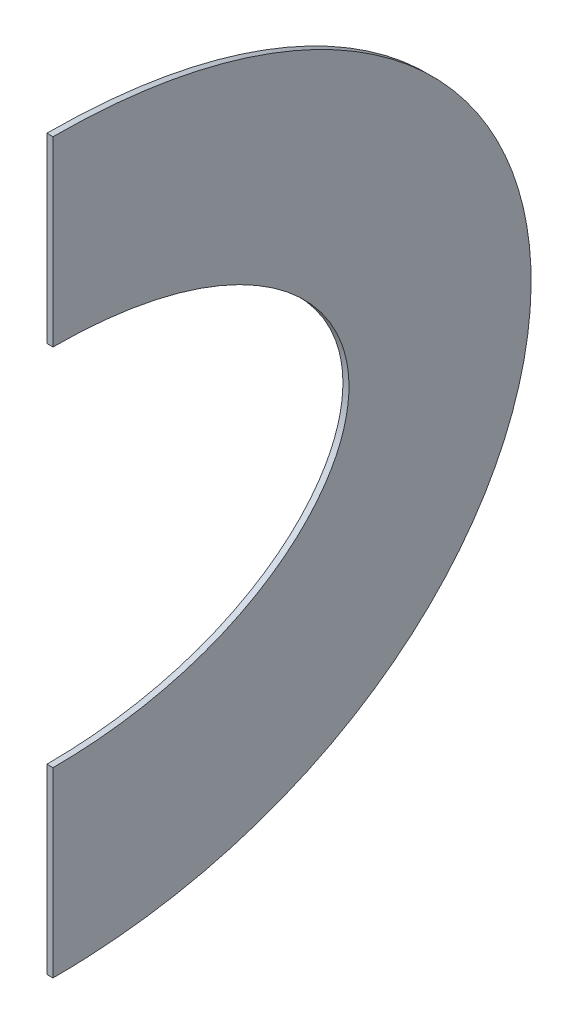
ISO-10303-21;
HEADER;
FILE_DESCRIPTION(('STEP AP214'),'2;1');
FILE_NAME('part.step','',(''),(''),'','','');
FILE_SCHEMA(('AUTOMOTIVE_DESIGN { 1 0 10303 214 1 1 1 1 }'));
ENDSEC;
DATA;
#1=APPLICATION_CONTEXT('core data for automotive mechanical design processes');
#2=APPLICATION_PROTOCOL_DEFINITION('international standard','automotive_design',2000,#1);
#3=PRODUCT_CONTEXT('',#1,'mechanical');
#4=PRODUCT('Part','Part','',(#3));
#5=PRODUCT_RELATED_PRODUCT_CATEGORY('part','',(#4));
#6=PRODUCT_DEFINITION_FORMATION('','',#4);
#7=PRODUCT_DEFINITION_CONTEXT('part definition',#1,'design');
#8=PRODUCT_DEFINITION('design','',#6,#7);
#9=PRODUCT_DEFINITION_SHAPE('','',#8);
#10=(LENGTH_UNIT() NAMED_UNIT(*) SI_UNIT(.MILLI.,.METRE.));
#11=(NAMED_UNIT(*) PLANE_ANGLE_UNIT() SI_UNIT($,.RADIAN.));
#12=(NAMED_UNIT(*) SI_UNIT($,.STERADIAN.) SOLID_ANGLE_UNIT());
#13=UNCERTAINTY_MEASURE_WITH_UNIT(LENGTH_MEASURE(1.E-05),#10,'distance_accuracy_value','');
#14=(GEOMETRIC_REPRESENTATION_CONTEXT(3) GLOBAL_UNCERTAINTY_ASSIGNED_CONTEXT((#13)) GLOBAL_UNIT_ASSIGNED_CONTEXT((#10,
#11,#12)) REPRESENTATION_CONTEXT('',''));
#15=CARTESIAN_POINT('',(0.,0.,0.));
#16=DIRECTION('',(0.,0.,1.));
#17=DIRECTION('',(1.,0.,0.));
#18=AXIS2_PLACEMENT_3D('',#15,#16,#17);
#19=CARTESIAN_POINT('',(0.,0.,0.));
#20=DIRECTION('',(0.,0.,-1.));
#21=DIRECTION('',(-1.,0.,0.));
#22=AXIS2_PLACEMENT_3D('',#19,#20,#21);
#23=PLANE('',#22);
#24=DIRECTION('',(0.,-1.,0.));
#25=VECTOR('',#24,1.);
#26=CARTESIAN_POINT('',(-1.,-30.,0.));
#27=LINE('',#26,#25);
#28=CARTESIAN_POINT('',(-1.,30.,0.));
#29=VERTEX_POINT('',#28);
#30=CARTESIAN_POINT('',(-1.,-30.,0.));
#31=VERTEX_POINT('',#30);
#32=EDGE_CURVE('E81',#29,#31,#27,.T.);
#33=ORIENTED_EDGE('',*,*,#32,.T.);
#34=DIRECTION('',(1.,0.,0.));
#35=VECTOR('',#34,1.);
#36=CARTESIAN_POINT('',(-1.,-30.,0.));
#37=LINE('',#36,#35);
#38=CARTESIAN_POINT('',(0.999999999999997,-30.,0.));
#39=VERTEX_POINT('',#38);
#40=EDGE_CURVE('E76',#31,#39,#37,.T.);
#41=ORIENTED_EDGE('',*,*,#40,.T.);
#42=DIRECTION('',(0.,1.,0.));
#43=VECTOR('',#42,1.);
#44=CARTESIAN_POINT('',(0.999999999999997,-30.,0.));
#45=LINE('',#44,#43);
#46=CARTESIAN_POINT('',(0.999999999999997,30.,0.));
#47=VERTEX_POINT('',#46);
#48=EDGE_CURVE('E93',#39,#47,#45,.T.);
#49=ORIENTED_EDGE('',*,*,#48,.T.);
#50=DIRECTION('',(-1.,0.,0.));
#51=VECTOR('',#50,1.);
#52=CARTESIAN_POINT('',(-1.,30.,0.));
#53=LINE('',#52,#51);
#54=EDGE_CURVE('E86',#47,#29,#53,.T.);
#55=ORIENTED_EDGE('',*,*,#54,.T.);
#56=EDGE_LOOP('',(#33,#41,#49,#55));
#57=FACE_BOUND('',#56,.T.);
#58=ADVANCED_FACE('F41',(#57),#23,.F.);
#59=CARTESIAN_POINT('',(0.,-180.,0.));
#60=DIRECTION('',(0.,0.,1.));
#61=DIRECTION('',(-1.,0.,0.));
#62=AXIS2_PLACEMENT_3D('',#59,#60,#61);
#63=PLANE('',#62);
#64=DIRECTION('',(0.,1.,0.));
#65=VECTOR('',#64,1.);
#66=CARTESIAN_POINT('',(-1.,-150.,0.));
#67=LINE('',#66,#65);
#68=CARTESIAN_POINT('',(-1.,-210.,0.));
#69=VERTEX_POINT('',#68);
#70=CARTESIAN_POINT('',(-1.,-150.,0.));
#71=VERTEX_POINT('',#70);
#72=EDGE_CURVE('E49',#69,#71,#67,.T.);
#73=ORIENTED_EDGE('',*,*,#72,.F.);
#74=DIRECTION('',(-1.,0.,0.));
#75=VECTOR('',#74,1.);
#76=CARTESIAN_POINT('',(-1.,-210.,0.));
#77=LINE('',#76,#75);
#78=CARTESIAN_POINT('',(0.999999999999997,-210.,0.));
#79=VERTEX_POINT('',#78);
#80=EDGE_CURVE('E64',#79,#69,#77,.T.);
#81=ORIENTED_EDGE('',*,*,#80,.F.);
#82=DIRECTION('',(0.,-1.,0.));
#83=VECTOR('',#82,1.);
#84=CARTESIAN_POINT('',(0.999999999999997,-150.,0.));
#85=LINE('',#84,#83);
#86=CARTESIAN_POINT('',(0.999999999999997,-150.,0.));
#87=VERTEX_POINT('',#86);
#88=EDGE_CURVE('E121',#87,#79,#85,.T.);
#89=ORIENTED_EDGE('',*,*,#88,.F.);
#90=DIRECTION('',(1.,0.,0.));
#91=VECTOR('',#90,1.);
#92=CARTESIAN_POINT('',(-1.,-150.,0.));
#93=LINE('',#92,#91);
#94=EDGE_CURVE('E11',#71,#87,#93,.T.);
#95=ORIENTED_EDGE('',*,*,#94,.F.);
#96=EDGE_LOOP('',(#73,#81,#89,#95));
#97=FACE_BOUND('',#96,.T.);
#98=ADVANCED_FACE('F142',(#97),#63,.T.);
#99=CARTESIAN_POINT('',(0.999999999999997,-30.,0.));
#100=DIRECTION('',(1.,0.,0.));
#101=DIRECTION('',(0.,0.,-1.));
#102=AXIS2_PLACEMENT_3D('',#99,#100,#101);
#103=PLANE('',#102);
#104=CARTESIAN_POINT('',(0.999999999999997,30.,0.));
#105=CARTESIAN_POINT('',(0.999999999999997,29.9999999998959,-22.815437881147));
#106=CARTESIAN_POINT('',(0.999999999999997,26.799748580839,-43.92047828463));
#107=CARTESIAN_POINT('',(0.999999999999997,15.0229079990081,-81.7746086235446));
#108=CARTESIAN_POINT('',(0.999999999999997,6.44849931047161,-98.5168866832723));
#109=CARTESIAN_POINT('',(0.999999999999997,-15.1915639766633,-126.568820574237));
#110=CARTESIAN_POINT('',(0.999999999999997,-28.2610036940798,-137.843453278536));
#111=CARTESIAN_POINT('',(0.999999999999997,-50.2374714033465,-149.482841731943));
#112=CARTESIAN_POINT('',(0.999999999999997,-57.9328509984214,-152.46584485097));
#113=CARTESIAN_POINT('',(0.999999999999997,-73.7477906734838,-156.475364389236));
#114=CARTESIAN_POINT('',(0.999999999999997,-81.8663202164909,-157.5));
#115=CARTESIAN_POINT('',(0.999999999999997,-98.1336797835091,-157.5));
#116=CARTESIAN_POINT('',(0.999999999999997,-106.252209326477,-156.475364389236));
#117=CARTESIAN_POINT('',(0.999999999999997,-122.067149001618,-152.46584485097));
#118=CARTESIAN_POINT('',(0.999999999999997,-129.762528596806,-149.482841732004));
#119=CARTESIAN_POINT('',(0.999999999999997,-151.738996305615,-137.843453278413));
#120=CARTESIAN_POINT('',(0.999999999999997,-164.808436023241,-126.568820573854));
#121=CARTESIAN_POINT('',(0.999999999999997,-186.448499310567,-98.5168866836557));
#122=CARTESIAN_POINT('',(0.999999999999997,-195.022907999136,-81.7746086224472));
#123=CARTESIAN_POINT('',(0.999999999999997,-206.799748580711,-43.9204782857274));
#124=CARTESIAN_POINT('',(0.999999999999997,-209.999999999167,-22.815437880323));
#125=CARTESIAN_POINT('',(0.999999999999997,-210.,0.));
#126=B_SPLINE_CURVE_WITH_KNOTS('',3,(#104,#105,#106,#107,#108,#109,#110,#111,#112,#113,#114,
#115,#116,#117,#118,#119,#120,#121,#122,#123,#124,#125),.UNSPECIFIED.,.F.,.F.,(4,2,2,2,2,2,2,2,
2,2,4),(0.,0.125,0.25,0.375,0.4375,0.5,0.5625,0.625,0.75,0.875,1.),.UNSPECIFIED.);
#127=EDGE_CURVE('E96',#47,#79,#126,.T.);
#128=ORIENTED_EDGE('',*,*,#127,.F.);
#129=ORIENTED_EDGE('',*,*,#48,.F.);
#130=CARTESIAN_POINT('',(0.999999999999997,-30.,0.));
#131=CARTESIAN_POINT('',(0.999999999999997,-30.0000000000347,-17.1918965585106));
#132=CARTESIAN_POINT('',(0.999999999999997,-32.4247485810213,-32.3099905394088));
#133=CARTESIAN_POINT('',(0.999999999999997,-40.3354079988257,-57.7371100524166));
#134=CARTESIAN_POINT('',(0.999999999999997,-45.8234993108569,-68.0456133166894));
#135=CARTESIAN_POINT('',(0.999999999999997,-57.9334360229514,-83.7436794258014));
#136=CARTESIAN_POINT('',(0.999999999999997,-64.5514963065123,-89.1682654715453));
#137=CARTESIAN_POINT('',(0.999999999999997,-74.2156535963574,-94.2866895180165));
#138=CARTESIAN_POINT('',(0.999999999999997,-77.4187115017449,-95.5077879615978));
#139=CARTESIAN_POINT('',(0.999999999999997,-83.7522093263499,-97.1135027981956));
#140=CARTESIAN_POINT('',(0.999999999999997,-86.8836797838057,-97.5));
#141=CARTESIAN_POINT('',(0.999999999999997,-93.1163202161943,-97.5));
#142=CARTESIAN_POINT('',(0.999999999999997,-96.2477906736897,-97.1135027981559));
#143=CARTESIAN_POINT('',(0.999999999999997,-102.581288498215,-95.5077879616374));
#144=CARTESIAN_POINT('',(0.999999999999997,-105.78434640355,-94.2866895181264));
#145=CARTESIAN_POINT('',(0.999999999999997,-115.448503693673,-89.1682654713254));
#146=CARTESIAN_POINT('',(0.999999999999997,-122.066563976138,-83.7436794261848));
#147=CARTESIAN_POINT('',(0.999999999999997,-134.176500690054,-68.045613316306));
#148=CARTESIAN_POINT('',(0.999999999999997,-139.664592000416,-57.7371100537163));
#149=CARTESIAN_POINT('',(0.999999999999997,-147.575251419737,-32.3099905381091));
#150=CARTESIAN_POINT('',(0.999999999999997,-149.999999999167,-17.1918965594865));
#151=CARTESIAN_POINT('',(0.999999999999997,-150.,0.));
#152=B_SPLINE_CURVE_WITH_KNOTS('',3,(#130,#131,#132,#133,#134,#135,#136,#137,#138,#139,#140,
#141,#142,#143,#144,#145,#146,#147,#148,#149,#150,#151),.UNSPECIFIED.,.F.,.F.,(4,2,2,2,2,2,2,2,
2,2,4),(0.,0.125,0.25,0.375,0.4375,0.5,0.5625,0.625,0.75,0.875,1.),.UNSPECIFIED.);
#153=EDGE_CURVE('E95',#39,#87,#152,.T.);
#154=ORIENTED_EDGE('',*,*,#153,.T.);
#155=ORIENTED_EDGE('',*,*,#88,.T.);
#156=EDGE_LOOP('',(#128,#129,#154,#155));
#157=FACE_BOUND('',#156,.T.);
#158=ADVANCED_FACE('F94',(#157),#103,.T.);
#159=CARTESIAN_POINT('',(0.999999999999997,30.,0.));
#160=CARTESIAN_POINT('',(0.999999999999997,29.9999999998959,-22.815437881147));
#161=CARTESIAN_POINT('',(0.999999999999997,26.799748580839,-43.92047828463));
#162=CARTESIAN_POINT('',(0.999999999999997,15.0229079990081,-81.7746086235446));
#163=CARTESIAN_POINT('',(0.999999999999997,6.44849931047161,-98.5168866832723));
#164=CARTESIAN_POINT('',(0.999999999999997,-15.1915639766633,-126.568820574237));
#165=CARTESIAN_POINT('',(0.999999999999997,-28.2610036940798,-137.843453278536));
#166=CARTESIAN_POINT('',(0.999999999999997,-50.2374714033465,-149.482841731943));
#167=CARTESIAN_POINT('',(0.999999999999997,-57.9328509984214,-152.46584485097));
#168=CARTESIAN_POINT('',(0.999999999999997,-73.7477906734838,-156.475364389236));
#169=CARTESIAN_POINT('',(0.999999999999997,-81.8663202164909,-157.5));
#170=CARTESIAN_POINT('',(0.999999999999997,-98.1336797835091,-157.5));
#171=CARTESIAN_POINT('',(0.999999999999997,-106.252209326477,-156.475364389236));
#172=CARTESIAN_POINT('',(0.999999999999997,-122.067149001618,-152.46584485097));
#173=CARTESIAN_POINT('',(0.999999999999997,-129.762528596806,-149.482841732004));
#174=CARTESIAN_POINT('',(0.999999999999997,-151.738996305615,-137.843453278413));
#175=CARTESIAN_POINT('',(0.999999999999997,-164.808436023241,-126.568820573854));
#176=CARTESIAN_POINT('',(0.999999999999997,-186.448499310567,-98.5168866836557));
#177=CARTESIAN_POINT('',(0.999999999999997,-195.022907999136,-81.7746086224472));
#178=CARTESIAN_POINT('',(0.999999999999997,-206.799748580711,-43.9204782857274));
#179=CARTESIAN_POINT('',(0.999999999999997,-209.999999999167,-22.815437880323));
#180=CARTESIAN_POINT('',(0.999999999999997,-210.,0.));
#181=CARTESIAN_POINT('',(-1.,30.,0.));
#182=CARTESIAN_POINT('',(-1.,29.9999999998959,-22.815437881147));
#183=CARTESIAN_POINT('',(-1.,26.799748580839,-43.92047828463));
#184=CARTESIAN_POINT('',(-1.,15.0229079990081,-81.7746086235446));
#185=CARTESIAN_POINT('',(-1.,6.44849931047161,-98.5168866832723));
#186=CARTESIAN_POINT('',(-1.,-15.1915639766633,-126.568820574237));
#187=CARTESIAN_POINT('',(-1.,-28.2610036940798,-137.843453278536));
#188=CARTESIAN_POINT('',(-1.,-50.2374714033465,-149.482841731943));
#189=CARTESIAN_POINT('',(-1.,-57.9328509984214,-152.46584485097));
#190=CARTESIAN_POINT('',(-1.,-73.7477906734838,-156.475364389236));
#191=CARTESIAN_POINT('',(-1.,-81.8663202164909,-157.5));
#192=CARTESIAN_POINT('',(-1.,-98.1336797835091,-157.5));
#193=CARTESIAN_POINT('',(-1.,-106.252209326477,-156.475364389236));
#194=CARTESIAN_POINT('',(-1.,-122.067149001618,-152.46584485097));
#195=CARTESIAN_POINT('',(-1.,-129.762528596806,-149.482841732004));
#196=CARTESIAN_POINT('',(-1.,-151.738996305615,-137.843453278413));
#197=CARTESIAN_POINT('',(-1.,-164.808436023241,-126.568820573854));
#198=CARTESIAN_POINT('',(-1.,-186.448499310567,-98.5168866836557));
#199=CARTESIAN_POINT('',(-1.,-195.022907999136,-81.7746086224472));
#200=CARTESIAN_POINT('',(-1.,-206.799748580711,-43.9204782857274));
#201=CARTESIAN_POINT('',(-1.,-209.999999999167,-22.815437880323));
#202=CARTESIAN_POINT('',(-1.,-210.,0.));
#203=B_SPLINE_SURFACE_WITH_KNOTS('',1,3,((#159,#160,#161,#162,#163,#164,#165,#166,#167,#168,
#169,#170,#171,#172,#173,#174,#175,#176,#177,#178,#179,#180),(#181,#182,#183,#184,#185,#186,
#187,#188,#189,#190,#191,#192,#193,#194,#195,#196,#197,#198,#199,#200,#201,#202)),.UNSPECIFIED.,
.F.,.F.,.F.,(2,2),(4,2,2,2,2,2,2,2,2,2,4),(0.,1.),(0.,0.125,0.25,0.375,0.4375,0.5,0.5625,0.625,
0.75,0.875,1.),.UNSPECIFIED.);
#204=CARTESIAN_POINT('',(-1.,30.,0.));
#205=CARTESIAN_POINT('',(-1.,29.9999999998959,-22.815437881147));
#206=CARTESIAN_POINT('',(-1.,26.799748580839,-43.92047828463));
#207=CARTESIAN_POINT('',(-1.,15.0229079990081,-81.7746086235446));
#208=CARTESIAN_POINT('',(-1.,6.44849931047161,-98.5168866832723));
#209=CARTESIAN_POINT('',(-1.,-15.1915639766633,-126.568820574237));
#210=CARTESIAN_POINT('',(-1.,-28.2610036940798,-137.843453278536));
#211=CARTESIAN_POINT('',(-1.,-50.2374714033465,-149.482841731943));
#212=CARTESIAN_POINT('',(-1.,-57.9328509984214,-152.46584485097));
#213=CARTESIAN_POINT('',(-1.,-73.7477906734838,-156.475364389236));
#214=CARTESIAN_POINT('',(-1.,-81.8663202164909,-157.5));
#215=CARTESIAN_POINT('',(-1.,-98.1336797835091,-157.5));
#216=CARTESIAN_POINT('',(-1.,-106.252209326477,-156.475364389236));
#217=CARTESIAN_POINT('',(-1.,-122.067149001618,-152.46584485097));
#218=CARTESIAN_POINT('',(-1.,-129.762528596806,-149.482841732004));
#219=CARTESIAN_POINT('',(-1.,-151.738996305615,-137.843453278413));
#220=CARTESIAN_POINT('',(-1.,-164.808436023241,-126.568820573854));
#221=CARTESIAN_POINT('',(-1.,-186.448499310567,-98.5168866836557));
#222=CARTESIAN_POINT('',(-1.,-195.022907999136,-81.7746086224472));
#223=CARTESIAN_POINT('',(-1.,-206.799748580711,-43.9204782857274));
#224=CARTESIAN_POINT('',(-1.,-209.999999999167,-22.815437880323));
#225=CARTESIAN_POINT('',(-1.,-210.,0.));
#226=B_SPLINE_CURVE_WITH_KNOTS('',3,(#204,#205,#206,#207,#208,#209,#210,#211,#212,#213,#214,
#215,#216,#217,#218,#219,#220,#221,#222,#223,#224,#225),.UNSPECIFIED.,.F.,.F.,(4,2,2,2,2,2,2,2,
2,2,4),(0.,0.125,0.25,0.375,0.4375,0.5,0.5625,0.625,0.75,0.875,1.),.UNSPECIFIED.);
#227=EDGE_CURVE('E106',#29,#69,#226,.T.);
#228=ORIENTED_EDGE('',*,*,#227,.F.);
#229=ORIENTED_EDGE('',*,*,#54,.F.);
#230=ORIENTED_EDGE('',*,*,#127,.T.);
#231=ORIENTED_EDGE('',*,*,#80,.T.);
#232=EDGE_LOOP('',(#228,#229,#230,#231));
#233=FACE_BOUND('',#232,.T.);
#234=ADVANCED_FACE('F143',(#233),#203,.F.);
#235=CARTESIAN_POINT('',(-1.,-30.,0.));
#236=DIRECTION('',(1.,0.,0.));
#237=DIRECTION('',(0.,0.,-1.));
#238=AXIS2_PLACEMENT_3D('',#235,#236,#237);
#239=PLANE('',#238);
#240=CARTESIAN_POINT('',(-1.,-30.,0.));
#241=CARTESIAN_POINT('',(-1.,-30.0000000000347,-17.1918965585106));
#242=CARTESIAN_POINT('',(-1.,-32.4247485810213,-32.3099905394088));
#243=CARTESIAN_POINT('',(-1.,-40.3354079988257,-57.7371100524166));
#244=CARTESIAN_POINT('',(-1.,-45.8234993108569,-68.0456133166894));
#245=CARTESIAN_POINT('',(-1.,-57.9334360229514,-83.7436794258014));
#246=CARTESIAN_POINT('',(-1.,-64.5514963065123,-89.1682654715453));
#247=CARTESIAN_POINT('',(-1.,-74.2156535963574,-94.2866895180165));
#248=CARTESIAN_POINT('',(-1.,-77.4187115017449,-95.5077879615978));
#249=CARTESIAN_POINT('',(-1.,-83.7522093263499,-97.1135027981956));
#250=CARTESIAN_POINT('',(-1.,-86.8836797838057,-97.5));
#251=CARTESIAN_POINT('',(-1.,-93.1163202161943,-97.5));
#252=CARTESIAN_POINT('',(-1.,-96.2477906736897,-97.1135027981559));
#253=CARTESIAN_POINT('',(-1.,-102.581288498215,-95.5077879616374));
#254=CARTESIAN_POINT('',(-1.,-105.78434640355,-94.2866895181264));
#255=CARTESIAN_POINT('',(-1.,-115.448503693673,-89.1682654713254));
#256=CARTESIAN_POINT('',(-1.,-122.066563976138,-83.7436794261848));
#257=CARTESIAN_POINT('',(-1.,-134.176500690054,-68.045613316306));
#258=CARTESIAN_POINT('',(-1.,-139.664592000416,-57.7371100537163));
#259=CARTESIAN_POINT('',(-1.,-147.575251419737,-32.3099905381091));
#260=CARTESIAN_POINT('',(-1.,-149.999999999167,-17.1918965594865));
#261=CARTESIAN_POINT('',(-1.,-150.,0.));
#262=B_SPLINE_CURVE_WITH_KNOTS('',3,(#240,#241,#242,#243,#244,#245,#246,#247,#248,#249,#250,
#251,#252,#253,#254,#255,#256,#257,#258,#259,#260,#261),.UNSPECIFIED.,.F.,.F.,(4,2,2,2,2,2,2,2,
2,2,4),(0.,0.125,0.25,0.375,0.4375,0.5,0.5625,0.625,0.75,0.875,1.),.UNSPECIFIED.);
#263=EDGE_CURVE('E126',#31,#71,#262,.T.);
#264=ORIENTED_EDGE('',*,*,#263,.F.);
#265=ORIENTED_EDGE('',*,*,#32,.F.);
#266=ORIENTED_EDGE('',*,*,#227,.T.);
#267=ORIENTED_EDGE('',*,*,#72,.T.);
#268=EDGE_LOOP('',(#264,#265,#266,#267));
#269=FACE_BOUND('',#268,.T.);
#270=ADVANCED_FACE('F145',(#269),#239,.F.);
#271=CARTESIAN_POINT('',(-1.,-30.,0.));
#272=CARTESIAN_POINT('',(-1.,-30.0000000000347,-17.1918965585106));
#273=CARTESIAN_POINT('',(-1.,-32.4247485810213,-32.3099905394088));
#274=CARTESIAN_POINT('',(-1.,-40.3354079988257,-57.7371100524166));
#275=CARTESIAN_POINT('',(-1.,-45.8234993108569,-68.0456133166894));
#276=CARTESIAN_POINT('',(-1.,-57.9334360229514,-83.7436794258014));
#277=CARTESIAN_POINT('',(-1.,-64.5514963065123,-89.1682654715453));
#278=CARTESIAN_POINT('',(-1.,-74.2156535963574,-94.2866895180165));
#279=CARTESIAN_POINT('',(-1.,-77.4187115017449,-95.5077879615978));
#280=CARTESIAN_POINT('',(-1.,-83.7522093263499,-97.1135027981956));
#281=CARTESIAN_POINT('',(-1.,-86.8836797838057,-97.5));
#282=CARTESIAN_POINT('',(-1.,-93.1163202161943,-97.5));
#283=CARTESIAN_POINT('',(-1.,-96.2477906736897,-97.1135027981559));
#284=CARTESIAN_POINT('',(-1.,-102.581288498215,-95.5077879616374));
#285=CARTESIAN_POINT('',(-1.,-105.78434640355,-94.2866895181264));
#286=CARTESIAN_POINT('',(-1.,-115.448503693673,-89.1682654713254));
#287=CARTESIAN_POINT('',(-1.,-122.066563976138,-83.7436794261848));
#288=CARTESIAN_POINT('',(-1.,-134.176500690054,-68.045613316306));
#289=CARTESIAN_POINT('',(-1.,-139.664592000416,-57.7371100537163));
#290=CARTESIAN_POINT('',(-1.,-147.575251419737,-32.3099905381091));
#291=CARTESIAN_POINT('',(-1.,-149.999999999167,-17.1918965594865));
#292=CARTESIAN_POINT('',(-1.,-150.,0.));
#293=CARTESIAN_POINT('',(0.999999999999997,-30.,0.));
#294=CARTESIAN_POINT('',(0.999999999999997,-30.0000000000347,-17.1918965585106));
#295=CARTESIAN_POINT('',(0.999999999999997,-32.4247485810213,-32.3099905394088));
#296=CARTESIAN_POINT('',(0.999999999999997,-40.3354079988257,-57.7371100524166));
#297=CARTESIAN_POINT('',(0.999999999999997,-45.8234993108569,-68.0456133166894));
#298=CARTESIAN_POINT('',(0.999999999999997,-57.9334360229514,-83.7436794258014));
#299=CARTESIAN_POINT('',(0.999999999999997,-64.5514963065123,-89.1682654715453));
#300=CARTESIAN_POINT('',(0.999999999999997,-74.2156535963574,-94.2866895180165));
#301=CARTESIAN_POINT('',(0.999999999999997,-77.4187115017449,-95.5077879615978));
#302=CARTESIAN_POINT('',(0.999999999999997,-83.7522093263499,-97.1135027981956));
#303=CARTESIAN_POINT('',(0.999999999999997,-86.8836797838057,-97.5));
#304=CARTESIAN_POINT('',(0.999999999999997,-93.1163202161943,-97.5));
#305=CARTESIAN_POINT('',(0.999999999999997,-96.2477906736897,-97.1135027981559));
#306=CARTESIAN_POINT('',(0.999999999999997,-102.581288498215,-95.5077879616374));
#307=CARTESIAN_POINT('',(0.999999999999997,-105.78434640355,-94.2866895181264));
#308=CARTESIAN_POINT('',(0.999999999999997,-115.448503693673,-89.1682654713254));
#309=CARTESIAN_POINT('',(0.999999999999997,-122.066563976138,-83.7436794261848));
#310=CARTESIAN_POINT('',(0.999999999999997,-134.176500690054,-68.045613316306));
#311=CARTESIAN_POINT('',(0.999999999999997,-139.664592000416,-57.7371100537163));
#312=CARTESIAN_POINT('',(0.999999999999997,-147.575251419737,-32.3099905381091));
#313=CARTESIAN_POINT('',(0.999999999999997,-149.999999999167,-17.1918965594865));
#314=CARTESIAN_POINT('',(0.999999999999997,-150.,0.));
#315=B_SPLINE_SURFACE_WITH_KNOTS('',1,3,((#271,#272,#273,#274,#275,#276,#277,#278,#279,#280,
#281,#282,#283,#284,#285,#286,#287,#288,#289,#290,#291,#292),(#293,#294,#295,#296,#297,#298,
#299,#300,#301,#302,#303,#304,#305,#306,#307,#308,#309,#310,#311,#312,#313,#314)),.UNSPECIFIED.,
.F.,.F.,.F.,(2,2),(4,2,2,2,2,2,2,2,2,2,4),(0.,1.),(0.,0.125,0.25,0.375,0.4375,0.5,0.5625,0.625,
0.75,0.875,1.),.UNSPECIFIED.);
#316=ORIENTED_EDGE('',*,*,#94,.T.);
#317=ORIENTED_EDGE('',*,*,#153,.F.);
#318=ORIENTED_EDGE('',*,*,#40,.F.);
#319=ORIENTED_EDGE('',*,*,#263,.T.);
#320=EDGE_LOOP('',(#316,#317,#318,#319));
#321=FACE_BOUND('',#320,.T.);
#322=ADVANCED_FACE('F101',(#321),#315,.F.);
#323=CLOSED_SHELL('',(#58,#98,#158,#234,#270,#322));
#324=MANIFOLD_SOLID_BREP('B2',#323);
#325=ADVANCED_BREP_SHAPE_REPRESENTATION('',(#18,#324),#14);
#326=SHAPE_DEFINITION_REPRESENTATION(#9,#325);
ENDSEC;
END-ISO-10303-21;
